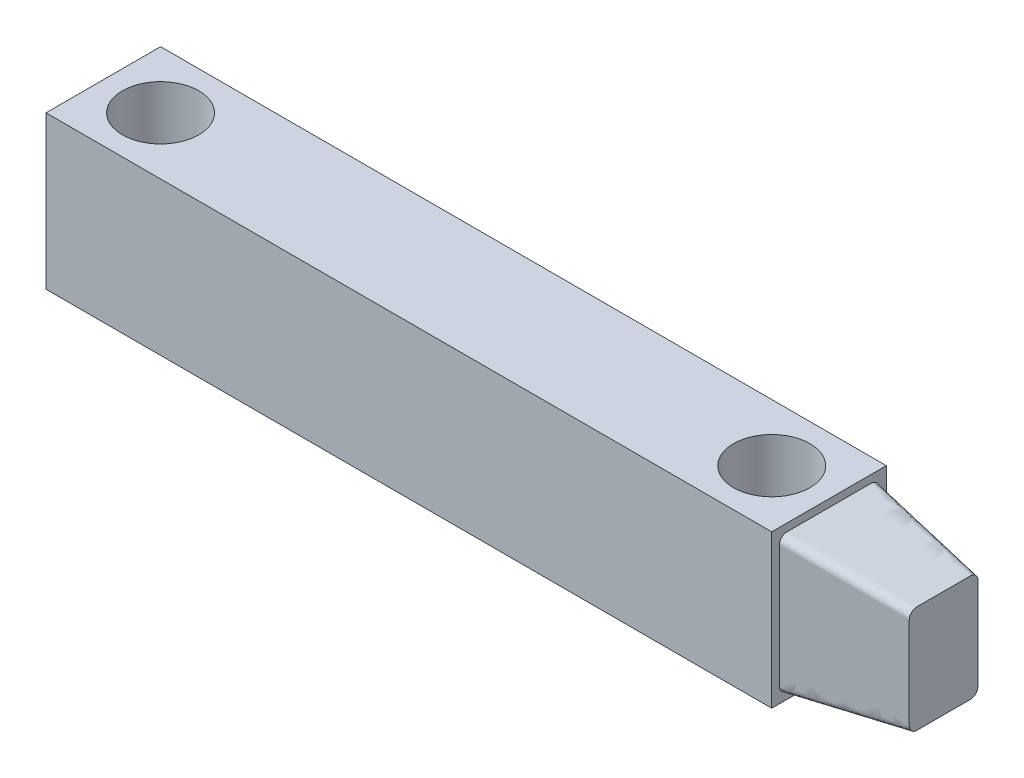
ISO-10303-21;
HEADER;
FILE_DESCRIPTION(('STEP AP214'),'2;1');
FILE_NAME('part.step','',(''),(''),'','','');
FILE_SCHEMA(('AUTOMOTIVE_DESIGN { 1 0 10303 214 1 1 1 1 }'));
ENDSEC;
DATA;
#1=APPLICATION_CONTEXT('core data for automotive mechanical design processes');
#2=APPLICATION_PROTOCOL_DEFINITION('international standard','automotive_design',2000,#1);
#3=PRODUCT_CONTEXT('',#1,'mechanical');
#4=PRODUCT('Part','Part','',(#3));
#5=PRODUCT_RELATED_PRODUCT_CATEGORY('part','',(#4));
#6=PRODUCT_DEFINITION_FORMATION('','',#4);
#7=PRODUCT_DEFINITION_CONTEXT('part definition',#1,'design');
#8=PRODUCT_DEFINITION('design','',#6,#7);
#9=PRODUCT_DEFINITION_SHAPE('','',#8);
#10=(LENGTH_UNIT() NAMED_UNIT(*) SI_UNIT(.MILLI.,.METRE.));
#11=(NAMED_UNIT(*) PLANE_ANGLE_UNIT() SI_UNIT($,.RADIAN.));
#12=(NAMED_UNIT(*) SI_UNIT($,.STERADIAN.) SOLID_ANGLE_UNIT());
#13=UNCERTAINTY_MEASURE_WITH_UNIT(LENGTH_MEASURE(1.E-05),#10,'distance_accuracy_value','');
#14=(GEOMETRIC_REPRESENTATION_CONTEXT(3) GLOBAL_UNCERTAINTY_ASSIGNED_CONTEXT((#13)) GLOBAL_UNIT_ASSIGNED_CONTEXT((#10,
#11,#12)) REPRESENTATION_CONTEXT('',''));
#15=CARTESIAN_POINT('',(0.,0.,0.));
#16=DIRECTION('',(0.,0.,1.));
#17=DIRECTION('',(1.,0.,0.));
#18=AXIS2_PLACEMENT_3D('',#15,#16,#17);
#19=CARTESIAN_POINT('',(-41.6375637366819,20.,20.9183932648402));
#20=DIRECTION('',(1.,0.,0.));
#21=DIRECTION('',(0.,0.,-1.));
#22=AXIS2_PLACEMENT_3D('',#19,#20,#21);
#23=PLANE('',#22);
#24=DIRECTION('',(0.,0.,1.));
#25=VECTOR('',#24,1.);
#26=CARTESIAN_POINT('',(-41.6375637366819,0.,20.9183932648402));
#27=LINE('',#26,#25);
#28=CARTESIAN_POINT('',(-41.6375637366819,0.,5.91839326484019));
#29=VERTEX_POINT('',#28);
#30=CARTESIAN_POINT('',(-41.6375637366819,0.,20.9183932648402));
#31=VERTEX_POINT('',#30);
#32=EDGE_CURVE('E262',#29,#31,#27,.T.);
#33=ORIENTED_EDGE('',*,*,#32,.T.);
#34=DIRECTION('',(0.,-1.,0.));
#35=VECTOR('',#34,1.);
#36=CARTESIAN_POINT('',(-41.6375637366819,20.,20.9183932648402));
#37=LINE('',#36,#35);
#38=CARTESIAN_POINT('',(-41.6375637366819,20.,20.9183932648402));
#39=VERTEX_POINT('',#38);
#40=EDGE_CURVE('E12',#39,#31,#37,.T.);
#41=ORIENTED_EDGE('',*,*,#40,.F.);
#42=DIRECTION('',(0.,0.,1.));
#43=VECTOR('',#42,1.);
#44=CARTESIAN_POINT('',(-41.6375637366819,20.,20.9183932648402));
#45=LINE('',#44,#43);
#46=CARTESIAN_POINT('',(-41.6375637366819,20.,5.91839326484019));
#47=VERTEX_POINT('',#46);
#48=EDGE_CURVE('E605',#47,#39,#45,.T.);
#49=ORIENTED_EDGE('',*,*,#48,.F.);
#50=DIRECTION('',(0.,-1.,0.));
#51=VECTOR('',#50,1.);
#52=CARTESIAN_POINT('',(-41.6375637366819,20.,5.91839326484019));
#53=LINE('',#52,#51);
#54=EDGE_CURVE('E609',#47,#29,#53,.T.);
#55=ORIENTED_EDGE('',*,*,#54,.T.);
#56=EDGE_LOOP('',(#33,#41,#49,#55));
#57=FACE_BOUND('',#56,.T.);
#58=ADVANCED_FACE('F143',(#57),#23,.F.);
#59=CARTESIAN_POINT('',(-41.6375637366819,20.,20.9183932648402));
#60=DIRECTION('',(0.,0.,-1.));
#61=DIRECTION('',(-1.,0.,0.));
#62=AXIS2_PLACEMENT_3D('',#59,#60,#61);
#63=PLANE('',#62);
#64=DIRECTION('',(1.,0.,0.));
#65=VECTOR('',#64,1.);
#66=CARTESIAN_POINT('',(-41.6375637366819,0.,20.9183932648402));
#67=LINE('',#66,#65);
#68=CARTESIAN_POINT('',(53.3624362633181,0.,20.9183932648402));
#69=VERTEX_POINT('',#68);
#70=EDGE_CURVE('E589',#31,#69,#67,.T.);
#71=ORIENTED_EDGE('',*,*,#70,.T.);
#72=DIRECTION('',(0.,-1.,0.));
#73=VECTOR('',#72,1.);
#74=CARTESIAN_POINT('',(53.3624362633181,20.,20.9183932648402));
#75=LINE('',#74,#73);
#76=CARTESIAN_POINT('',(53.3624362633181,20.,20.9183932648402));
#77=VERTEX_POINT('',#76);
#78=EDGE_CURVE('E152',#77,#69,#75,.T.);
#79=ORIENTED_EDGE('',*,*,#78,.F.);
#80=DIRECTION('',(1.,0.,0.));
#81=VECTOR('',#80,1.);
#82=CARTESIAN_POINT('',(-41.6375637366819,20.,20.9183932648402));
#83=LINE('',#82,#81);
#84=EDGE_CURVE('E197',#39,#77,#83,.T.);
#85=ORIENTED_EDGE('',*,*,#84,.F.);
#86=ORIENTED_EDGE('',*,*,#40,.T.);
#87=EDGE_LOOP('',(#71,#79,#85,#86));
#88=FACE_BOUND('',#87,.T.);
#89=ADVANCED_FACE('F446',(#88),#63,.F.);
#90=CARTESIAN_POINT('',(53.3624362633181,20.,20.9183932648402));
#91=DIRECTION('',(-1.,0.,0.));
#92=DIRECTION('',(0.,0.,1.));
#93=AXIS2_PLACEMENT_3D('',#90,#91,#92);
#94=PLANE('',#93);
#95=DIRECTION('',(0.,1.,0.));
#96=VECTOR('',#95,1.);
#97=CARTESIAN_POINT('',(53.3624362633181,18.,19.9183932648402));
#98=LINE('',#97,#96);
#99=CARTESIAN_POINT('',(53.3624362633181,1.99999999975424,19.9183932648402));
#100=VERTEX_POINT('',#99);
#101=CARTESIAN_POINT('',(53.3624362633181,18.,19.9183932648402));
#102=VERTEX_POINT('',#101);
#103=EDGE_CURVE('E402',#100,#102,#98,.T.);
#104=ORIENTED_EDGE('',*,*,#103,.T.);
#105=CARTESIAN_POINT('',(53.3624362633181,18.,18.9183932648402));
#106=DIRECTION('',(1.,0.,0.));
#107=DIRECTION('',(0.,0.,1.));
#108=AXIS2_PLACEMENT_3D('',#105,#106,#107);
#109=CIRCLE('',#108,1.);
#110=CARTESIAN_POINT('',(53.3624362633181,19.,18.9183932647959));
#111=VERTEX_POINT('',#110);
#112=EDGE_CURVE('E146',#102,#111,#109,.F.);
#113=ORIENTED_EDGE('',*,*,#112,.T.);
#114=DIRECTION('',(0.,0.,-1.));
#115=VECTOR('',#114,1.);
#116=CARTESIAN_POINT('',(53.3624362633181,19.,18.9183932648402));
#117=LINE('',#116,#115);
#118=CARTESIAN_POINT('',(53.3624362633181,19.,7.91839326484066));
#119=VERTEX_POINT('',#118);
#120=EDGE_CURVE('E479',#111,#119,#117,.T.);
#121=ORIENTED_EDGE('',*,*,#120,.T.);
#122=CARTESIAN_POINT('',(53.3624362633181,18.,7.91839326484019));
#123=DIRECTION('',(-1.,0.,0.));
#124=DIRECTION('',(0.,0.,-1.));
#125=AXIS2_PLACEMENT_3D('',#122,#123,#124);
#126=CIRCLE('',#125,1.);
#127=CARTESIAN_POINT('',(53.3624362633181,18.0000000002457,6.91839326484019));
#128=VERTEX_POINT('',#127);
#129=EDGE_CURVE('E480',#119,#128,#126,.T.);
#130=ORIENTED_EDGE('',*,*,#129,.T.);
#131=DIRECTION('',(0.,-1.,0.));
#132=VECTOR('',#131,1.);
#133=CARTESIAN_POINT('',(53.3624362633181,18.,6.91839326484019));
#134=LINE('',#133,#132);
#135=CARTESIAN_POINT('',(53.3624362633181,2.00000000000001,6.91839326484018));
#136=VERTEX_POINT('',#135);
#137=EDGE_CURVE('E481',#128,#136,#134,.T.);
#138=ORIENTED_EDGE('',*,*,#137,.T.);
#139=CARTESIAN_POINT('',(53.3624362633181,2.,7.91839326484018));
#140=DIRECTION('',(1.,0.,0.));
#141=DIRECTION('',(0.,0.,-1.));
#142=AXIS2_PLACEMENT_3D('',#139,#140,#141);
#143=CIRCLE('',#142,1.);
#144=CARTESIAN_POINT('',(53.3624362633181,1.,7.91839326487176));
#145=VERTEX_POINT('',#144);
#146=EDGE_CURVE('E515',#136,#145,#143,.F.);
#147=ORIENTED_EDGE('',*,*,#146,.T.);
#148=DIRECTION('',(0.,0.,1.));
#149=VECTOR('',#148,1.);
#150=CARTESIAN_POINT('',(53.3624362633181,1.,18.9183932648402));
#151=LINE('',#150,#149);
#152=CARTESIAN_POINT('',(53.3624362633181,0.999999999999999,18.9183932648397));
#153=VERTEX_POINT('',#152);
#154=EDGE_CURVE('E414',#145,#153,#151,.T.);
#155=ORIENTED_EDGE('',*,*,#154,.T.);
#156=CARTESIAN_POINT('',(53.3624362633181,2.,18.9183932648402));
#157=DIRECTION('',(-1.,0.,0.));
#158=DIRECTION('',(0.,0.,1.));
#159=AXIS2_PLACEMENT_3D('',#156,#157,#158);
#160=CIRCLE('',#159,1.);
#161=EDGE_CURVE('E405',#153,#100,#160,.T.);
#162=ORIENTED_EDGE('',*,*,#161,.T.);
#163=EDGE_LOOP('',(#104,#113,#121,#130,#138,#147,#155,#162));
#164=FACE_BOUND('',#163,.T.);
#165=DIRECTION('',(0.,0.,-1.));
#166=VECTOR('',#165,1.);
#167=CARTESIAN_POINT('',(53.3624362633181,0.,20.9183932648402));
#168=LINE('',#167,#166);
#169=CARTESIAN_POINT('',(53.3624362633181,0.,5.91839326484019));
#170=VERTEX_POINT('',#169);
#171=EDGE_CURVE('E597',#69,#170,#168,.T.);
#172=ORIENTED_EDGE('',*,*,#171,.T.);
#173=DIRECTION('',(0.,-1.,0.));
#174=VECTOR('',#173,1.);
#175=CARTESIAN_POINT('',(53.3624362633181,20.,5.91839326484019));
#176=LINE('',#175,#174);
#177=CARTESIAN_POINT('',(53.3624362633181,20.,5.91839326484019));
#178=VERTEX_POINT('',#177);
#179=EDGE_CURVE('E601',#178,#170,#176,.T.);
#180=ORIENTED_EDGE('',*,*,#179,.F.);
#181=DIRECTION('',(0.,0.,-1.));
#182=VECTOR('',#181,1.);
#183=CARTESIAN_POINT('',(53.3624362633181,20.,20.9183932648402));
#184=LINE('',#183,#182);
#185=EDGE_CURVE('E600',#77,#178,#184,.T.);
#186=ORIENTED_EDGE('',*,*,#185,.F.);
#187=ORIENTED_EDGE('',*,*,#78,.T.);
#188=EDGE_LOOP('',(#172,#180,#186,#187));
#189=FACE_BOUND('',#188,.T.);
#190=ADVANCED_FACE('F426',(#164,#189),#94,.F.);
#191=CARTESIAN_POINT('',(-41.6375637366819,20.,5.91839326484019));
#192=DIRECTION('',(0.,0.,1.));
#193=DIRECTION('',(1.,0.,0.));
#194=AXIS2_PLACEMENT_3D('',#191,#192,#193);
#195=PLANE('',#194);
#196=DIRECTION('',(-1.,0.,0.));
#197=VECTOR('',#196,1.);
#198=CARTESIAN_POINT('',(-41.6375637366819,0.,5.91839326484019));
#199=LINE('',#198,#197);
#200=EDGE_CURVE('E190',#170,#29,#199,.T.);
#201=ORIENTED_EDGE('',*,*,#200,.T.);
#202=ORIENTED_EDGE('',*,*,#54,.F.);
#203=DIRECTION('',(-1.,0.,0.));
#204=VECTOR('',#203,1.);
#205=CARTESIAN_POINT('',(-41.6375637366819,20.,5.91839326484019));
#206=LINE('',#205,#204);
#207=EDGE_CURVE('E169',#178,#47,#206,.T.);
#208=ORIENTED_EDGE('',*,*,#207,.F.);
#209=ORIENTED_EDGE('',*,*,#179,.T.);
#210=EDGE_LOOP('',(#201,#202,#208,#209));
#211=FACE_BOUND('',#210,.T.);
#212=ADVANCED_FACE('F445',(#211),#195,.F.);
#213=CARTESIAN_POINT('',(0.,20.,0.));
#214=DIRECTION('',(0.,-1.,0.));
#215=DIRECTION('',(0.,0.,-1.));
#216=AXIS2_PLACEMENT_3D('',#213,#214,#215);
#217=PLANE('',#216);
#218=CARTESIAN_POINT('',(45.8624362633181,20.,13.4183932648402));
#219=DIRECTION('',(0.,-1.,0.));
#220=DIRECTION('',(0.,0.,-1.));
#221=AXIS2_PLACEMENT_3D('',#218,#219,#220);
#222=CIRCLE('',#221,4.99999999999999);
#223=CARTESIAN_POINT('',(45.8624362633181,20.,8.41839326484019));
#224=VERTEX_POINT('',#223);
#225=EDGE_CURVE('E627',#224,#224,#222,.T.);
#226=ORIENTED_EDGE('',*,*,#225,.T.);
#227=EDGE_LOOP('',(#226));
#228=FACE_BOUND('',#227,.T.);
#229=CARTESIAN_POINT('',(-34.1375637366819,20.,13.4183932648402));
#230=DIRECTION('',(0.,-1.,0.));
#231=DIRECTION('',(0.,0.,-1.));
#232=AXIS2_PLACEMENT_3D('',#229,#230,#231);
#233=CIRCLE('',#232,4.99999999999999);
#234=CARTESIAN_POINT('',(-34.1375637366819,20.,8.41839326484019));
#235=VERTEX_POINT('',#234);
#236=EDGE_CURVE('E406',#235,#235,#233,.T.);
#237=ORIENTED_EDGE('',*,*,#236,.T.);
#238=EDGE_LOOP('',(#237));
#239=FACE_BOUND('',#238,.T.);
#240=ORIENTED_EDGE('',*,*,#48,.T.);
#241=ORIENTED_EDGE('',*,*,#84,.T.);
#242=ORIENTED_EDGE('',*,*,#185,.T.);
#243=ORIENTED_EDGE('',*,*,#207,.T.);
#244=EDGE_LOOP('',(#240,#241,#242,#243));
#245=FACE_BOUND('',#244,.T.);
#246=ADVANCED_FACE('F288',(#228,#239,#245),#217,.F.);
#247=CARTESIAN_POINT('',(0.,0.,0.));
#248=DIRECTION('',(0.,-1.,0.));
#249=DIRECTION('',(0.,0.,-1.));
#250=AXIS2_PLACEMENT_3D('',#247,#248,#249);
#251=PLANE('',#250);
#252=CARTESIAN_POINT('',(45.8624362633181,0.,13.4183932648402));
#253=DIRECTION('',(0.,-1.,0.));
#254=DIRECTION('',(0.,0.,-1.));
#255=AXIS2_PLACEMENT_3D('',#252,#253,#254);
#256=CIRCLE('',#255,5.);
#257=CARTESIAN_POINT('',(45.8624362633181,0.,8.41839326484019));
#258=VERTEX_POINT('',#257);
#259=EDGE_CURVE('E637',#258,#258,#256,.T.);
#260=ORIENTED_EDGE('',*,*,#259,.F.);
#261=EDGE_LOOP('',(#260));
#262=FACE_BOUND('',#261,.T.);
#263=CARTESIAN_POINT('',(-34.1375637366819,0.,13.4183932648402));
#264=DIRECTION('',(0.,-1.,0.));
#265=DIRECTION('',(0.,0.,-1.));
#266=AXIS2_PLACEMENT_3D('',#263,#264,#265);
#267=CIRCLE('',#266,4.99999999999999);
#268=CARTESIAN_POINT('',(-34.1375637366819,0.,8.41839326484019));
#269=VERTEX_POINT('',#268);
#270=EDGE_CURVE('E631',#269,#269,#267,.T.);
#271=ORIENTED_EDGE('',*,*,#270,.F.);
#272=EDGE_LOOP('',(#271));
#273=FACE_BOUND('',#272,.T.);
#274=ORIENTED_EDGE('',*,*,#32,.F.);
#275=ORIENTED_EDGE('',*,*,#200,.F.);
#276=ORIENTED_EDGE('',*,*,#171,.F.);
#277=ORIENTED_EDGE('',*,*,#70,.F.);
#278=EDGE_LOOP('',(#274,#275,#276,#277));
#279=FACE_BOUND('',#278,.T.);
#280=ADVANCED_FACE('F603',(#262,#273,#279),#251,.T.);
#281=CARTESIAN_POINT('',(68.3624362633181,16.,17.9183932648402));
#282=CARTESIAN_POINT('',(53.3624362633181,18.,19.9183932648402));
#283=CARTESIAN_POINT('',(68.3624362633181,16.1165028492441,17.9183932648402));
#284=CARTESIAN_POINT('',(53.3624362633181,18.15085033717,19.9183932648402));
#285=CARTESIAN_POINT('',(68.3624362633181,16.3721711430188,17.8778373891583));
#286=CARTESIAN_POINT('',(53.3624362633181,18.4102516612811,19.8547229271879));
#287=CARTESIAN_POINT('',(68.3624362633182,16.7432003813611,17.635521799958));
#288=CARTESIAN_POINT('',(53.3624362633182,18.7157291440134,19.6486274317412));
#289=CARTESIAN_POINT('',(68.3624362633181,16.9647009871385,17.2676181145165));
#290=CARTESIAN_POINT('',(53.3624362633181,18.9296555026498,19.3447183964727));
#291=CARTESIAN_POINT('',(68.3624362633181,17.,17.0278589309283));
#292=CARTESIAN_POINT('',(53.3624362633181,19.,19.0789465432986));
#293=CARTESIAN_POINT('',(68.3624362633181,17.,16.3134888373016));
#294=CARTESIAN_POINT('',(53.3624362633182,19.,18.0311800182939));
#295=CARTESIAN_POINT('',(68.3624362633182,17.,15.1377120716938));
#296=CARTESIAN_POINT('',(53.3624362633181,19.,16.2146589323194));
#297=CARTESIAN_POINT('',(68.362436263318,17.,13.4183991597575));
#298=CARTESIAN_POINT('',(53.3624362633181,19.,13.4183906412595));
#299=CARTESIAN_POINT('',(68.3624362633182,17.,11.6990655271395));
#300=CARTESIAN_POINT('',(53.3624362633182,19.,10.62213391784));
#301=CARTESIAN_POINT('',(68.3624362633181,17.,10.5232976923788));
#302=CARTESIAN_POINT('',(53.3624362633181,19.,8.80560651138644));
#303=CARTESIAN_POINT('',(68.3624362633181,17.,9.80892759875212));
#304=CARTESIAN_POINT('',(53.3624362633181,19.,7.75783998638176));
#305=CARTESIAN_POINT('',(68.3624362633182,16.9647009871385,9.56916841516392));
#306=CARTESIAN_POINT('',(53.3624362633181,18.9296555026497,7.49206813320768));
#307=CARTESIAN_POINT('',(68.3624362633181,16.7432003813611,9.20126472972235));
#308=CARTESIAN_POINT('',(53.3624362633182,18.7157291440135,7.18815909793921));
#309=CARTESIAN_POINT('',(68.3624362633181,16.3721711430188,8.95894914052211));
#310=CARTESIAN_POINT('',(53.3624362633181,18.410251661281,6.98206360249244));
#311=CARTESIAN_POINT('',(68.3624362633181,16.1165028492441,8.91839326484018));
#312=CARTESIAN_POINT('',(53.3624362633181,18.15085033717,6.91839326484019));
#313=CARTESIAN_POINT('',(68.3624362633181,14.9855173971663,8.91839326484017));
#314=CARTESIAN_POINT('',(53.3624362633181,16.6864266094486,6.91839326484019));
#315=CARTESIAN_POINT('',(68.362436263318,12.9787213664249,8.91839326484017));
#316=CARTESIAN_POINT('',(53.3624362633181,14.0302573222829,6.91839326484019));
#317=CARTESIAN_POINT('',(68.3624362633182,10.0000012719678,8.9183932648402));
#318=CARTESIAN_POINT('',(53.3624362633181,9.99999880527172,6.91839326484018));
#319=CARTESIAN_POINT('',(68.3624362633181,7.02127654612315,8.91839326484018));
#320=CARTESIAN_POINT('',(53.3624362633182,5.96974502077478,6.91839326484019));
#321=CARTESIAN_POINT('',(68.3624362633181,5.01448260283368,8.91839326484019));
#322=CARTESIAN_POINT('',(53.3624362633181,3.3135733905514,6.91839326484018));
#323=CARTESIAN_POINT('',(68.3624362633181,3.88349715075586,8.91839326484019));
#324=CARTESIAN_POINT('',(53.3624362633181,1.84914966283005,6.91839326484018));
#325=CARTESIAN_POINT('',(68.3624362633182,3.62782885698116,8.95894914052212));
#326=CARTESIAN_POINT('',(53.3624362633181,1.58974833871895,6.98206360249244));
#327=CARTESIAN_POINT('',(68.362436263318,3.25679961863893,9.20126472972234));
#328=CARTESIAN_POINT('',(53.3624362633182,1.28427085598654,7.1881590979392));
#329=CARTESIAN_POINT('',(68.3624362633182,3.03529901286149,9.56916841516392));
#330=CARTESIAN_POINT('',(53.3624362633181,1.07034449735027,7.49206813320768));
#331=CARTESIAN_POINT('',(68.3624362633181,3.,9.80892759875212));
#332=CARTESIAN_POINT('',(53.3624362633181,1.,7.75783998638177));
#333=CARTESIAN_POINT('',(68.3624362633181,3.,10.5232976923788));
#334=CARTESIAN_POINT('',(53.3624362633182,1.,8.80560651138643));
#335=CARTESIAN_POINT('',(68.3624362633182,3.,11.6990744579866));
#336=CARTESIAN_POINT('',(53.3624362633181,1.,10.6221339178401));
#337=CARTESIAN_POINT('',(68.3624362633181,3.,13.4183873699229));
#338=CARTESIAN_POINT('',(53.3624362633182,1.,13.4183906412595));
#339=CARTESIAN_POINT('',(68.3624362633181,3.,15.1377210025409));
#340=CARTESIAN_POINT('',(53.3624362633181,1.,16.2146589323194));
#341=CARTESIAN_POINT('',(68.3624362633181,3.,16.3134888373016));
#342=CARTESIAN_POINT('',(53.3624362633181,1.,18.0311800182939));
#343=CARTESIAN_POINT('',(68.3624362633181,3.,17.0278589309283));
#344=CARTESIAN_POINT('',(53.3624362633181,0.999999999999999,19.0789465432986));
#345=CARTESIAN_POINT('',(68.362436263318,3.03529901286148,17.2676181145165));
#346=CARTESIAN_POINT('',(53.3624362633182,1.07034449735026,19.3447183964727));
#347=CARTESIAN_POINT('',(68.3624362633182,3.25679961863894,17.635521799958));
#348=CARTESIAN_POINT('',(53.3624362633181,1.28427085598654,19.6486274317411));
#349=CARTESIAN_POINT('',(68.3624362633181,3.62782885698115,17.8778373891583));
#350=CARTESIAN_POINT('',(53.3624362633182,1.58974833871895,19.8547229271879));
#351=CARTESIAN_POINT('',(68.3624362633181,3.88349715075586,17.9183932648402));
#352=CARTESIAN_POINT('',(53.3624362633181,1.84914966283005,19.9183932648402));
#353=CARTESIAN_POINT('',(68.3624362633182,5.01448260283368,17.9183932648402));
#354=CARTESIAN_POINT('',(53.3624362633182,3.31357339055141,19.9183932648402));
#355=CARTESIAN_POINT('',(68.3624362633182,7.02127654612317,17.9183932648402));
#356=CARTESIAN_POINT('',(53.3624362633182,5.96974267771709,19.9183932648402));
#357=CARTESIAN_POINT('',(68.3624362633181,10.0000012719678,17.9183932648402));
#358=CARTESIAN_POINT('',(53.362436263318,10.0000011947283,19.9183932648402));
#359=CARTESIAN_POINT('',(68.3624362633181,12.9787213664249,17.9183932648402));
#360=CARTESIAN_POINT('',(53.3624362633182,14.0302549792252,19.9183932648402));
#361=CARTESIAN_POINT('',(68.3624362633181,14.9855173971663,17.9183932648402));
#362=CARTESIAN_POINT('',(53.3624362633181,16.6864266094486,19.9183932648402));
#363=CARTESIAN_POINT('',(68.3624362633181,16.,17.9183932648402));
#364=CARTESIAN_POINT('',(53.3624362633181,18.,19.9183932648402));
#365=B_SPLINE_SURFACE_WITH_KNOTS('',3,1,((#281,#282),(#283,#284),(#285,#286),(#287,#288),(#289,
#290),(#291,#292),(#293,#294),(#295,#296),(#297,#298),(#299,#300),(#301,#302),(#303,#304),(#305,
#306),(#307,#308),(#309,#310),(#311,#312),(#313,#314),(#315,#316),(#317,#318),(#319,#320),(#321,
#322),(#323,#324),(#325,#326),(#327,#328),(#329,#330),(#331,#332),(#333,#334),(#335,#336),(#337,
#338),(#339,#340),(#341,#342),(#343,#344),(#345,#346),(#347,#348),(#349,#350),(#351,#352),(#353,
#354),(#355,#356),(#357,#358),(#359,#360),(#361,#362),(#363,#364)),.UNSPECIFIED.,.T.,.F.,.F.,(4,
1,1,1,2,1,1,1,2,1,1,1,2,1,1,1,2,1,1,1,2,1,1,1,2,1,1,1,2,1,1,1,4),(2,2),(0.,0.0077,0.0154,0.0231,
0.0308,0.07335,0.1159,0.15845,0.201,0.2087,0.2164,0.2241,0.2318,0.29885,0.3659,0.43295,0.5,
0.5077,0.5154,0.5231,0.5308,0.57335,0.6159,0.65845,0.701,0.7087,0.7164,0.7241,0.7318,0.79885,
0.8659,0.93295,1.),(0.,1.),.UNSPECIFIED.);
#366=CARTESIAN_POINT('',(68.3624362633181,16.,16.9183932648402));
#367=DIRECTION('',(-1.,0.,0.));
#368=DIRECTION('',(0.,0.,-1.));
#369=AXIS2_PLACEMENT_3D('',#366,#367,#368);
#370=CIRCLE('',#369,1.);
#371=CARTESIAN_POINT('',(68.3624362633181,16.,17.9183932648402));
#372=VERTEX_POINT('',#371);
#373=CARTESIAN_POINT('',(68.3624362633181,17.,16.9183932648402));
#374=VERTEX_POINT('',#373);
#375=EDGE_CURVE('E248',#372,#374,#370,.T.);
#376=DIRECTION('',(0.,0.,-1.));
#377=VECTOR('',#376,1.);
#378=CARTESIAN_POINT('',(68.3624362633181,17.,16.9183932648402));
#379=LINE('',#378,#377);
#380=CARTESIAN_POINT('',(68.3624362633181,17.,9.91839326480912));
#381=VERTEX_POINT('',#380);
#382=EDGE_CURVE('E260',#374,#381,#379,.T.);
#383=CARTESIAN_POINT('',(68.3624362633181,16.,9.91839326484019));
#384=DIRECTION('',(-1.,0.,0.));
#385=DIRECTION('',(0.,0.,-1.));
#386=AXIS2_PLACEMENT_3D('',#383,#384,#385);
#387=CIRCLE('',#386,1.);
#388=CARTESIAN_POINT('',(68.3624362633181,16.0000000000007,8.91839326484018));
#389=VERTEX_POINT('',#388);
#390=EDGE_CURVE('E374',#381,#389,#387,.T.);
#391=DIRECTION('',(0.,-1.,0.));
#392=VECTOR('',#391,1.);
#393=CARTESIAN_POINT('',(68.3624362633181,16.,8.91839326484018));
#394=LINE('',#393,#392);
#395=CARTESIAN_POINT('',(68.3624362633181,4.,8.91839326484019));
#396=VERTEX_POINT('',#395);
#397=EDGE_CURVE('E339',#389,#396,#394,.T.);
#398=CARTESIAN_POINT('',(68.3624362633181,4.,9.91839326484018));
#399=DIRECTION('',(-1.,0.,0.));
#400=DIRECTION('',(0.,0.,1.));
#401=AXIS2_PLACEMENT_3D('',#398,#399,#400);
#402=CIRCLE('',#401,0.999999999999999);
#403=CARTESIAN_POINT('',(68.3624362633181,3.,9.91839326484018));
#404=VERTEX_POINT('',#403);
#405=EDGE_CURVE('E335',#396,#404,#402,.T.);
#406=DIRECTION('',(0.,0.,1.));
#407=VECTOR('',#406,1.);
#408=CARTESIAN_POINT('',(68.3624362633181,3.,16.9183932648402));
#409=LINE('',#408,#407);
#410=CARTESIAN_POINT('',(68.3624362633181,3.,16.9183932648712));
#411=VERTEX_POINT('',#410);
#412=EDGE_CURVE('E333',#404,#411,#409,.T.);
#413=CARTESIAN_POINT('',(68.3624362633181,4.,16.9183932648402));
#414=DIRECTION('',(-1.,0.,0.));
#415=DIRECTION('',(0.,0.,-1.));
#416=AXIS2_PLACEMENT_3D('',#413,#414,#415);
#417=CIRCLE('',#416,1.);
#418=CARTESIAN_POINT('',(68.3624362633181,3.99999999999935,17.9183932648402));
#419=VERTEX_POINT('',#418);
#420=EDGE_CURVE('E251',#411,#419,#417,.T.);
#421=DIRECTION('',(0.,1.,0.));
#422=VECTOR('',#421,1.);
#423=CARTESIAN_POINT('',(68.3624362633181,16.,17.9183932648402));
#424=LINE('',#423,#422);
#425=EDGE_CURVE('E243',#419,#372,#424,.T.);
#426=ORIENTED_EDGE('',*,*,#375,.T.);
#427=ORIENTED_EDGE('',*,*,#382,.T.);
#428=ORIENTED_EDGE('',*,*,#390,.T.);
#429=ORIENTED_EDGE('',*,*,#397,.T.);
#430=ORIENTED_EDGE('',*,*,#405,.T.);
#431=ORIENTED_EDGE('',*,*,#412,.T.);
#432=ORIENTED_EDGE('',*,*,#420,.T.);
#433=ORIENTED_EDGE('',*,*,#425,.T.);
#434=EDGE_LOOP('',(#426,#427,#428,#429,#430,#431,#432,#433));
#435=FACE_BOUND('',#434,.T.);
#436=ORIENTED_EDGE('',*,*,#112,.F.);
#437=ORIENTED_EDGE('',*,*,#103,.F.);
#438=ORIENTED_EDGE('',*,*,#161,.F.);
#439=ORIENTED_EDGE('',*,*,#154,.F.);
#440=ORIENTED_EDGE('',*,*,#146,.F.);
#441=ORIENTED_EDGE('',*,*,#137,.F.);
#442=ORIENTED_EDGE('',*,*,#129,.F.);
#443=ORIENTED_EDGE('',*,*,#120,.F.);
#444=EDGE_LOOP('',(#436,#437,#438,#439,#440,#441,#442,#443));
#445=FACE_BOUND('',#444,.T.);
#446=ADVANCED_FACE('F246',(#435,#445),#365,.T.);
#447=CARTESIAN_POINT('',(68.3624362633181,4.,8.91839326484019));
#448=DIRECTION('',(1.,0.,-3.42189327057519E-13));
#449=DIRECTION('',(-3.42189327057519E-13,0.,-1.));
#450=AXIS2_PLACEMENT_3D('',#447,#448,#449);
#451=PLANE('',#450);
#452=ORIENTED_EDGE('',*,*,#375,.F.);
#453=ORIENTED_EDGE('',*,*,#425,.F.);
#454=ORIENTED_EDGE('',*,*,#420,.F.);
#455=ORIENTED_EDGE('',*,*,#412,.F.);
#456=ORIENTED_EDGE('',*,*,#405,.F.);
#457=ORIENTED_EDGE('',*,*,#397,.F.);
#458=ORIENTED_EDGE('',*,*,#390,.F.);
#459=ORIENTED_EDGE('',*,*,#382,.F.);
#460=EDGE_LOOP('',(#452,#453,#454,#455,#456,#457,#458,#459));
#461=FACE_BOUND('',#460,.T.);
#462=ADVANCED_FACE('F259',(#461),#451,.T.);
#463=CARTESIAN_POINT('',(-34.1375637366819,0.,13.4183932648402));
#464=DIRECTION('',(0.,-1.,0.));
#465=DIRECTION('',(0.,0.,-1.));
#466=AXIS2_PLACEMENT_3D('',#463,#464,#465);
#467=CYLINDRICAL_SURFACE('',#466,4.99999999999999);
#468=ORIENTED_EDGE('',*,*,#236,.F.);
#469=EDGE_LOOP('',(#468));
#470=FACE_BOUND('',#469,.T.);
#471=ORIENTED_EDGE('',*,*,#270,.T.);
#472=EDGE_LOOP('',(#471));
#473=FACE_BOUND('',#472,.T.);
#474=ADVANCED_FACE('F283',(#470,#473),#467,.F.);
#475=CARTESIAN_POINT('',(45.8624362633181,0.,13.4183932648402));
#476=DIRECTION('',(0.,-1.,0.));
#477=DIRECTION('',(0.,0.,-1.));
#478=AXIS2_PLACEMENT_3D('',#475,#476,#477);
#479=CYLINDRICAL_SURFACE('',#478,4.99999999999999);
#480=ORIENTED_EDGE('',*,*,#225,.F.);
#481=EDGE_LOOP('',(#480));
#482=FACE_BOUND('',#481,.T.);
#483=ORIENTED_EDGE('',*,*,#259,.T.);
#484=EDGE_LOOP('',(#483));
#485=FACE_BOUND('',#484,.T.);
#486=ADVANCED_FACE('F641',(#482,#485),#479,.F.);
#487=CLOSED_SHELL('',(#58,#89,#190,#212,#246,#280,#446,#462,#474,#486));
#488=MANIFOLD_SOLID_BREP('B2',#487);
#489=ADVANCED_BREP_SHAPE_REPRESENTATION('',(#18,#488),#14);
#490=SHAPE_DEFINITION_REPRESENTATION(#9,#489);
ENDSEC;
END-ISO-10303-21;
